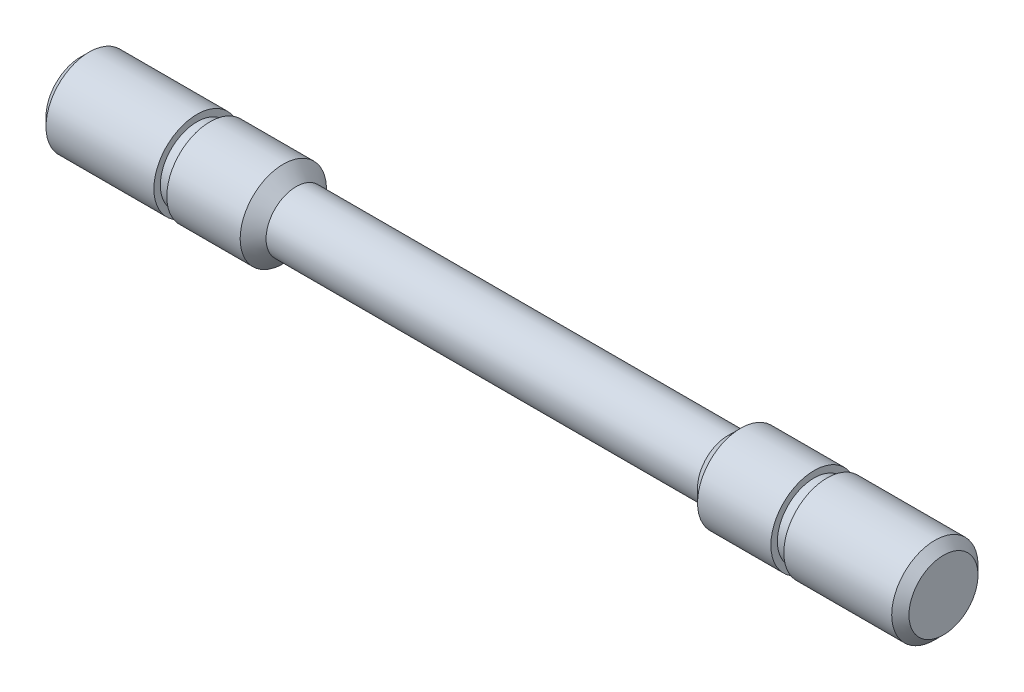
ISO-10303-21;
HEADER;
FILE_DESCRIPTION(('STEP AP214'),'2;1');
FILE_NAME('part.step','',(''),(''),'','','');
FILE_SCHEMA(('AUTOMOTIVE_DESIGN { 1 0 10303 214 1 1 1 1 }'));
ENDSEC;
DATA;
#1=APPLICATION_CONTEXT('core data for automotive mechanical design processes');
#2=APPLICATION_PROTOCOL_DEFINITION('international standard','automotive_design',2000,#1);
#3=PRODUCT_CONTEXT('',#1,'mechanical');
#4=PRODUCT('Part','Part','',(#3));
#5=PRODUCT_RELATED_PRODUCT_CATEGORY('part','',(#4));
#6=PRODUCT_DEFINITION_FORMATION('','',#4);
#7=PRODUCT_DEFINITION_CONTEXT('part definition',#1,'design');
#8=PRODUCT_DEFINITION('design','',#6,#7);
#9=PRODUCT_DEFINITION_SHAPE('','',#8);
#10=(LENGTH_UNIT() NAMED_UNIT(*) SI_UNIT(.MILLI.,.METRE.));
#11=(NAMED_UNIT(*) PLANE_ANGLE_UNIT() SI_UNIT($,.RADIAN.));
#12=(NAMED_UNIT(*) SI_UNIT($,.STERADIAN.) SOLID_ANGLE_UNIT());
#13=UNCERTAINTY_MEASURE_WITH_UNIT(LENGTH_MEASURE(1.E-05),#10,'distance_accuracy_value','');
#14=(GEOMETRIC_REPRESENTATION_CONTEXT(3) GLOBAL_UNCERTAINTY_ASSIGNED_CONTEXT((#13)) GLOBAL_UNIT_ASSIGNED_CONTEXT((#10,
#11,#12)) REPRESENTATION_CONTEXT('',''));
#15=CARTESIAN_POINT('',(0.,0.,0.));
#16=DIRECTION('',(0.,0.,1.));
#17=DIRECTION('',(1.,0.,0.));
#18=AXIS2_PLACEMENT_3D('',#15,#16,#17);
#19=CARTESIAN_POINT('',(-50.,0.,0.));
#20=DIRECTION('',(-1.,0.,0.));
#21=DIRECTION('',(0.,0.,1.));
#22=AXIS2_PLACEMENT_3D('',#19,#20,#21);
#23=CYLINDRICAL_SURFACE('',#22,3.5);
#24=CARTESIAN_POINT('',(-25.,0.,0.));
#25=DIRECTION('',(-1.,0.,0.));
#26=DIRECTION('',(0.,0.,1.));
#27=AXIS2_PLACEMENT_3D('',#24,#25,#26);
#28=CIRCLE('',#27,3.5);
#29=CARTESIAN_POINT('',(-25.,0.,3.5));
#30=VERTEX_POINT('',#29);
#31=EDGE_CURVE('E10',#30,#30,#28,.T.);
#32=ORIENTED_EDGE('',*,*,#31,.F.);
#33=EDGE_LOOP('',(#32));
#34=FACE_BOUND('',#33,.T.);
#35=CARTESIAN_POINT('',(25.,0.,0.));
#36=DIRECTION('',(-1.,0.,0.));
#37=DIRECTION('',(0.,0.,1.));
#38=AXIS2_PLACEMENT_3D('',#35,#36,#37);
#39=CIRCLE('',#38,3.5);
#40=CARTESIAN_POINT('',(25.,0.,3.5));
#41=VERTEX_POINT('',#40);
#42=EDGE_CURVE('E63',#41,#41,#39,.T.);
#43=ORIENTED_EDGE('',*,*,#42,.T.);
#44=EDGE_LOOP('',(#43));
#45=FACE_BOUND('',#44,.T.);
#46=ADVANCED_FACE('F32',(#34,#45),#23,.T.);
#47=CARTESIAN_POINT('',(-25.,0.,0.));
#48=DIRECTION('',(-1.,0.,0.));
#49=DIRECTION('',(0.,0.,1.));
#50=AXIS2_PLACEMENT_3D('',#47,#48,#49);
#51=CONICAL_SURFACE('',#50,3.5,0.78539816339745);
#52=CARTESIAN_POINT('',(-26.5,0.,0.));
#53=DIRECTION('',(-1.,0.,0.));
#54=DIRECTION('',(0.,0.,1.));
#55=AXIS2_PLACEMENT_3D('',#52,#53,#54);
#56=CIRCLE('',#55,5.);
#57=CARTESIAN_POINT('',(-26.5,0.,5.));
#58=VERTEX_POINT('',#57);
#59=EDGE_CURVE('E38',#58,#58,#56,.T.);
#60=ORIENTED_EDGE('',*,*,#59,.F.);
#61=EDGE_LOOP('',(#60));
#62=FACE_BOUND('',#61,.T.);
#63=ORIENTED_EDGE('',*,*,#31,.T.);
#64=EDGE_LOOP('',(#63));
#65=FACE_BOUND('',#64,.T.);
#66=ADVANCED_FACE('F100',(#62,#65),#51,.T.);
#67=CARTESIAN_POINT('',(-50.,0.,0.));
#68=DIRECTION('',(-1.,0.,0.));
#69=DIRECTION('',(0.,0.,1.));
#70=AXIS2_PLACEMENT_3D('',#67,#68,#69);
#71=CYLINDRICAL_SURFACE('',#70,5.);
#72=CARTESIAN_POINT('',(-35.,0.,0.));
#73=DIRECTION('',(-1.,0.,0.));
#74=DIRECTION('',(0.,0.,1.));
#75=AXIS2_PLACEMENT_3D('',#72,#73,#74);
#76=CIRCLE('',#75,5.);
#77=CARTESIAN_POINT('',(-35.,0.,5.));
#78=VERTEX_POINT('',#77);
#79=EDGE_CURVE('E42',#78,#78,#76,.T.);
#80=ORIENTED_EDGE('',*,*,#79,.F.);
#81=EDGE_LOOP('',(#80));
#82=FACE_BOUND('',#81,.T.);
#83=ORIENTED_EDGE('',*,*,#59,.T.);
#84=EDGE_LOOP('',(#83));
#85=FACE_BOUND('',#84,.T.);
#86=ADVANCED_FACE('F105',(#82,#85),#71,.T.);
#87=CARTESIAN_POINT('',(-35.,5.,0.));
#88=DIRECTION('',(1.,0.,0.));
#89=DIRECTION('',(0.,0.,-1.));
#90=AXIS2_PLACEMENT_3D('',#87,#88,#89);
#91=PLANE('',#90);
#92=CARTESIAN_POINT('',(-35.,0.,0.));
#93=DIRECTION('',(-1.,0.,0.));
#94=DIRECTION('',(0.,0.,1.));
#95=AXIS2_PLACEMENT_3D('',#92,#93,#94);
#96=CIRCLE('',#95,4.25);
#97=CARTESIAN_POINT('',(-35.,0.,4.25));
#98=VERTEX_POINT('',#97);
#99=EDGE_CURVE('E46',#98,#98,#96,.T.);
#100=ORIENTED_EDGE('',*,*,#99,.F.);
#101=EDGE_LOOP('',(#100));
#102=FACE_BOUND('',#101,.T.);
#103=ORIENTED_EDGE('',*,*,#79,.T.);
#104=EDGE_LOOP('',(#103));
#105=FACE_BOUND('',#104,.T.);
#106=ADVANCED_FACE('F142',(#102,#105),#91,.F.);
#107=CARTESIAN_POINT('',(-50.,0.,0.));
#108=DIRECTION('',(-1.,0.,0.));
#109=DIRECTION('',(0.,0.,1.));
#110=AXIS2_PLACEMENT_3D('',#107,#108,#109);
#111=CYLINDRICAL_SURFACE('',#110,4.25);
#112=CARTESIAN_POINT('',(-36.5,0.,0.));
#113=DIRECTION('',(-1.,0.,0.));
#114=DIRECTION('',(0.,0.,1.));
#115=AXIS2_PLACEMENT_3D('',#112,#113,#114);
#116=CIRCLE('',#115,4.25);
#117=CARTESIAN_POINT('',(-36.5,0.,4.25));
#118=VERTEX_POINT('',#117);
#119=EDGE_CURVE('E51',#118,#118,#116,.T.);
#120=ORIENTED_EDGE('',*,*,#119,.F.);
#121=EDGE_LOOP('',(#120));
#122=FACE_BOUND('',#121,.T.);
#123=ORIENTED_EDGE('',*,*,#99,.T.);
#124=EDGE_LOOP('',(#123));
#125=FACE_BOUND('',#124,.T.);
#126=ADVANCED_FACE('F138',(#122,#125),#111,.T.);
#127=CARTESIAN_POINT('',(-36.5,4.25,0.));
#128=DIRECTION('',(-1.,0.,0.));
#129=DIRECTION('',(0.,0.,1.));
#130=AXIS2_PLACEMENT_3D('',#127,#128,#129);
#131=PLANE('',#130);
#132=CARTESIAN_POINT('',(-36.5,0.,0.));
#133=DIRECTION('',(-1.,0.,0.));
#134=DIRECTION('',(0.,0.,1.));
#135=AXIS2_PLACEMENT_3D('',#132,#133,#134);
#136=CIRCLE('',#135,5.);
#137=CARTESIAN_POINT('',(-36.5,0.,5.));
#138=VERTEX_POINT('',#137);
#139=EDGE_CURVE('E54',#138,#138,#136,.T.);
#140=ORIENTED_EDGE('',*,*,#139,.F.);
#141=EDGE_LOOP('',(#140));
#142=FACE_BOUND('',#141,.T.);
#143=ORIENTED_EDGE('',*,*,#119,.T.);
#144=EDGE_LOOP('',(#143));
#145=FACE_BOUND('',#144,.T.);
#146=ADVANCED_FACE('F134',(#142,#145),#131,.F.);
#147=CARTESIAN_POINT('',(-50.,0.,0.));
#148=DIRECTION('',(-1.,0.,0.));
#149=DIRECTION('',(0.,0.,1.));
#150=AXIS2_PLACEMENT_3D('',#147,#148,#149);
#151=CYLINDRICAL_SURFACE('',#150,5.);
#152=CARTESIAN_POINT('',(-49.,0.,0.));
#153=DIRECTION('',(-1.,0.,0.));
#154=DIRECTION('',(0.,0.,1.));
#155=AXIS2_PLACEMENT_3D('',#152,#153,#154);
#156=CIRCLE('',#155,5.);
#157=CARTESIAN_POINT('',(-49.,0.,5.));
#158=VERTEX_POINT('',#157);
#159=EDGE_CURVE('E57',#158,#158,#156,.T.);
#160=ORIENTED_EDGE('',*,*,#159,.F.);
#161=EDGE_LOOP('',(#160));
#162=FACE_BOUND('',#161,.T.);
#163=ORIENTED_EDGE('',*,*,#139,.T.);
#164=EDGE_LOOP('',(#163));
#165=FACE_BOUND('',#164,.T.);
#166=ADVANCED_FACE('F130',(#162,#165),#151,.T.);
#167=CARTESIAN_POINT('',(-49.,0.,0.));
#168=DIRECTION('',(1.,0.,0.));
#169=DIRECTION('',(0.,0.,-1.));
#170=AXIS2_PLACEMENT_3D('',#167,#168,#169);
#171=CONICAL_SURFACE('',#170,5.,0.785398163397447);
#172=CARTESIAN_POINT('',(-50.,0.,0.));
#173=DIRECTION('',(-1.,0.,0.));
#174=DIRECTION('',(0.,0.,1.));
#175=AXIS2_PLACEMENT_3D('',#172,#173,#174);
#176=CIRCLE('',#175,4.);
#177=CARTESIAN_POINT('',(-50.,0.,4.));
#178=VERTEX_POINT('',#177);
#179=EDGE_CURVE('E60',#178,#178,#176,.T.);
#180=ORIENTED_EDGE('',*,*,#179,.F.);
#181=EDGE_LOOP('',(#180));
#182=FACE_BOUND('',#181,.T.);
#183=ORIENTED_EDGE('',*,*,#159,.T.);
#184=EDGE_LOOP('',(#183));
#185=FACE_BOUND('',#184,.T.);
#186=ADVANCED_FACE('F123',(#182,#185),#171,.T.);
#187=CARTESIAN_POINT('',(-50.,4.,0.));
#188=DIRECTION('',(1.,0.,0.));
#189=DIRECTION('',(0.,0.,-1.));
#190=AXIS2_PLACEMENT_3D('',#187,#188,#189);
#191=PLANE('',#190);
#192=ORIENTED_EDGE('',*,*,#179,.T.);
#193=EDGE_LOOP('',(#192));
#194=FACE_BOUND('',#193,.T.);
#195=ADVANCED_FACE('F113',(#194),#191,.F.);
#196=CARTESIAN_POINT('',(25.,0.,0.));
#197=DIRECTION('',(1.,0.,0.));
#198=DIRECTION('',(0.,0.,1.));
#199=AXIS2_PLACEMENT_3D('',#196,#197,#198);
#200=CONICAL_SURFACE('',#199,3.5,0.78539816339745);
#201=CARTESIAN_POINT('',(26.5,0.,0.));
#202=DIRECTION('',(-1.,0.,0.));
#203=DIRECTION('',(0.,0.,1.));
#204=AXIS2_PLACEMENT_3D('',#201,#202,#203);
#205=CIRCLE('',#204,5.);
#206=CARTESIAN_POINT('',(26.5,0.,5.));
#207=VERTEX_POINT('',#206);
#208=EDGE_CURVE('E66',#207,#207,#205,.T.);
#209=ORIENTED_EDGE('',*,*,#208,.T.);
#210=EDGE_LOOP('',(#209));
#211=FACE_BOUND('',#210,.T.);
#212=ORIENTED_EDGE('',*,*,#42,.F.);
#213=EDGE_LOOP('',(#212));
#214=FACE_BOUND('',#213,.T.);
#215=ADVANCED_FACE('F110',(#211,#214),#200,.T.);
#216=CARTESIAN_POINT('',(50.,0.,0.));
#217=DIRECTION('',(1.,0.,0.));
#218=DIRECTION('',(0.,0.,1.));
#219=AXIS2_PLACEMENT_3D('',#216,#217,#218);
#220=CYLINDRICAL_SURFACE('',#219,5.);
#221=CARTESIAN_POINT('',(35.,0.,0.));
#222=DIRECTION('',(-1.,0.,0.));
#223=DIRECTION('',(0.,0.,1.));
#224=AXIS2_PLACEMENT_3D('',#221,#222,#223);
#225=CIRCLE('',#224,5.);
#226=CARTESIAN_POINT('',(35.,0.,5.));
#227=VERTEX_POINT('',#226);
#228=EDGE_CURVE('E69',#227,#227,#225,.T.);
#229=ORIENTED_EDGE('',*,*,#228,.T.);
#230=EDGE_LOOP('',(#229));
#231=FACE_BOUND('',#230,.T.);
#232=ORIENTED_EDGE('',*,*,#208,.F.);
#233=EDGE_LOOP('',(#232));
#234=FACE_BOUND('',#233,.T.);
#235=ADVANCED_FACE('F112',(#231,#234),#220,.T.);
#236=CARTESIAN_POINT('',(35.,5.,0.));
#237=DIRECTION('',(-1.,0.,0.));
#238=DIRECTION('',(0.,0.,-1.));
#239=AXIS2_PLACEMENT_3D('',#236,#237,#238);
#240=PLANE('',#239);
#241=CARTESIAN_POINT('',(35.,0.,0.));
#242=DIRECTION('',(-1.,0.,0.));
#243=DIRECTION('',(0.,0.,1.));
#244=AXIS2_PLACEMENT_3D('',#241,#242,#243);
#245=CIRCLE('',#244,4.25);
#246=CARTESIAN_POINT('',(35.,0.,4.25));
#247=VERTEX_POINT('',#246);
#248=EDGE_CURVE('E72',#247,#247,#245,.T.);
#249=ORIENTED_EDGE('',*,*,#248,.T.);
#250=EDGE_LOOP('',(#249));
#251=FACE_BOUND('',#250,.T.);
#252=ORIENTED_EDGE('',*,*,#228,.F.);
#253=EDGE_LOOP('',(#252));
#254=FACE_BOUND('',#253,.T.);
#255=ADVANCED_FACE('F120',(#251,#254),#240,.F.);
#256=CARTESIAN_POINT('',(50.,0.,0.));
#257=DIRECTION('',(1.,0.,0.));
#258=DIRECTION('',(0.,0.,1.));
#259=AXIS2_PLACEMENT_3D('',#256,#257,#258);
#260=CYLINDRICAL_SURFACE('',#259,4.25);
#261=CARTESIAN_POINT('',(36.5,0.,0.));
#262=DIRECTION('',(-1.,0.,0.));
#263=DIRECTION('',(0.,0.,1.));
#264=AXIS2_PLACEMENT_3D('',#261,#262,#263);
#265=CIRCLE('',#264,4.25);
#266=CARTESIAN_POINT('',(36.5,0.,4.25));
#267=VERTEX_POINT('',#266);
#268=EDGE_CURVE('E75',#267,#267,#265,.T.);
#269=ORIENTED_EDGE('',*,*,#268,.T.);
#270=EDGE_LOOP('',(#269));
#271=FACE_BOUND('',#270,.T.);
#272=ORIENTED_EDGE('',*,*,#248,.F.);
#273=EDGE_LOOP('',(#272));
#274=FACE_BOUND('',#273,.T.);
#275=ADVANCED_FACE('F204',(#271,#274),#260,.T.);
#276=CARTESIAN_POINT('',(36.5,4.25,0.));
#277=DIRECTION('',(1.,0.,0.));
#278=DIRECTION('',(0.,0.,1.));
#279=AXIS2_PLACEMENT_3D('',#276,#277,#278);
#280=PLANE('',#279);
#281=CARTESIAN_POINT('',(36.5,0.,0.));
#282=DIRECTION('',(-1.,0.,0.));
#283=DIRECTION('',(0.,0.,1.));
#284=AXIS2_PLACEMENT_3D('',#281,#282,#283);
#285=CIRCLE('',#284,5.);
#286=CARTESIAN_POINT('',(36.5,0.,5.));
#287=VERTEX_POINT('',#286);
#288=EDGE_CURVE('E78',#287,#287,#285,.T.);
#289=ORIENTED_EDGE('',*,*,#288,.T.);
#290=EDGE_LOOP('',(#289));
#291=FACE_BOUND('',#290,.T.);
#292=ORIENTED_EDGE('',*,*,#268,.F.);
#293=EDGE_LOOP('',(#292));
#294=FACE_BOUND('',#293,.T.);
#295=ADVANCED_FACE('F213',(#291,#294),#280,.F.);
#296=CARTESIAN_POINT('',(50.,0.,0.));
#297=DIRECTION('',(1.,0.,0.));
#298=DIRECTION('',(0.,0.,1.));
#299=AXIS2_PLACEMENT_3D('',#296,#297,#298);
#300=CYLINDRICAL_SURFACE('',#299,5.);
#301=CARTESIAN_POINT('',(49.,0.,0.));
#302=DIRECTION('',(-1.,0.,0.));
#303=DIRECTION('',(0.,0.,1.));
#304=AXIS2_PLACEMENT_3D('',#301,#302,#303);
#305=CIRCLE('',#304,5.);
#306=CARTESIAN_POINT('',(49.,0.,5.));
#307=VERTEX_POINT('',#306);
#308=EDGE_CURVE('E81',#307,#307,#305,.T.);
#309=ORIENTED_EDGE('',*,*,#308,.T.);
#310=EDGE_LOOP('',(#309));
#311=FACE_BOUND('',#310,.T.);
#312=ORIENTED_EDGE('',*,*,#288,.F.);
#313=EDGE_LOOP('',(#312));
#314=FACE_BOUND('',#313,.T.);
#315=ADVANCED_FACE('F97',(#311,#314),#300,.T.);
#316=CARTESIAN_POINT('',(49.,0.,0.));
#317=DIRECTION('',(-1.,0.,0.));
#318=DIRECTION('',(0.,0.,-1.));
#319=AXIS2_PLACEMENT_3D('',#316,#317,#318);
#320=CONICAL_SURFACE('',#319,5.,0.785398163397447);
#321=CARTESIAN_POINT('',(50.,0.,0.));
#322=DIRECTION('',(-1.,0.,0.));
#323=DIRECTION('',(0.,0.,1.));
#324=AXIS2_PLACEMENT_3D('',#321,#322,#323);
#325=CIRCLE('',#324,4.);
#326=CARTESIAN_POINT('',(50.,0.,4.));
#327=VERTEX_POINT('',#326);
#328=EDGE_CURVE('E84',#327,#327,#325,.T.);
#329=ORIENTED_EDGE('',*,*,#328,.T.);
#330=EDGE_LOOP('',(#329));
#331=FACE_BOUND('',#330,.T.);
#332=ORIENTED_EDGE('',*,*,#308,.F.);
#333=EDGE_LOOP('',(#332));
#334=FACE_BOUND('',#333,.T.);
#335=ADVANCED_FACE('F88',(#331,#334),#320,.T.);
#336=CARTESIAN_POINT('',(50.,4.,0.));
#337=DIRECTION('',(-1.,0.,0.));
#338=DIRECTION('',(0.,0.,-1.));
#339=AXIS2_PLACEMENT_3D('',#336,#337,#338);
#340=PLANE('',#339);
#341=ORIENTED_EDGE('',*,*,#328,.F.);
#342=EDGE_LOOP('',(#341));
#343=FACE_BOUND('',#342,.T.);
#344=ADVANCED_FACE('F91',(#343),#340,.F.);
#345=CLOSED_SHELL('',(#46,#66,#86,#106,#126,#146,#166,#186,#195,#215,#235,#255,#275,#295,#315,
#335,#344));
#346=MANIFOLD_SOLID_BREP('B2',#345);
#347=ADVANCED_BREP_SHAPE_REPRESENTATION('',(#18,#346),#14);
#348=SHAPE_DEFINITION_REPRESENTATION(#9,#347);
ENDSEC;
END-ISO-10303-21;
